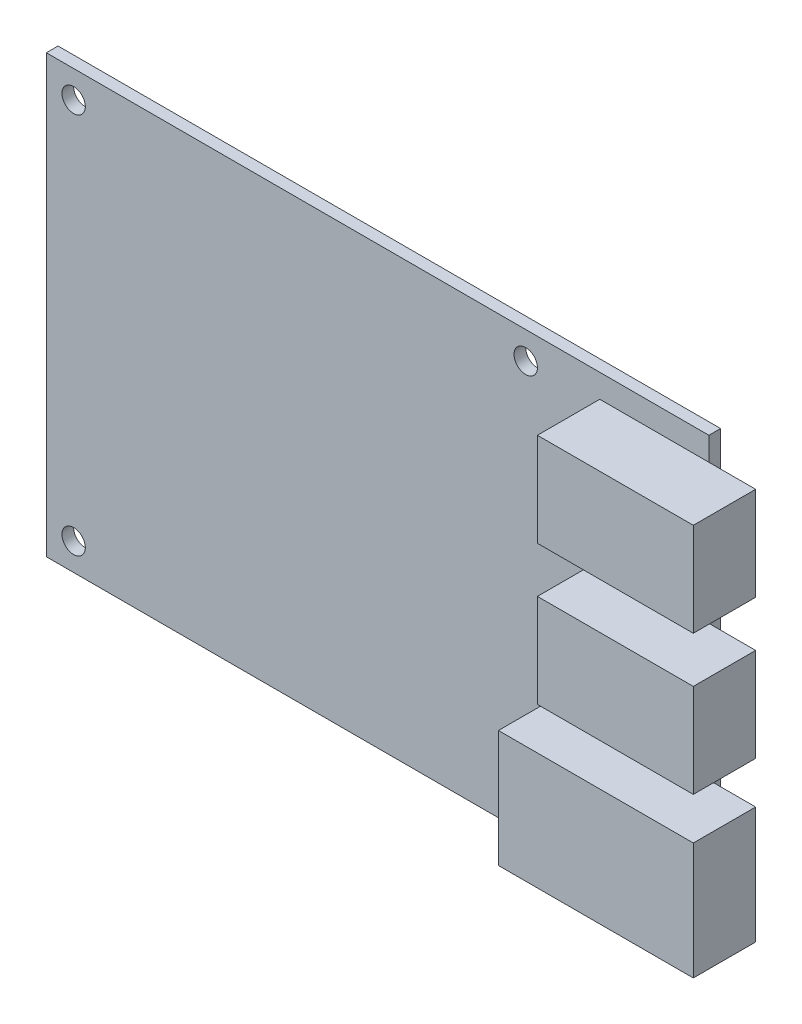
ISO-10303-21;
HEADER;
FILE_DESCRIPTION(('STEP AP214'),'2;1');
FILE_NAME('part.step','',(''),(''),'','','');
FILE_SCHEMA(('AUTOMOTIVE_DESIGN { 1 0 10303 214 1 1 1 1 }'));
ENDSEC;
DATA;
#1=APPLICATION_CONTEXT('core data for automotive mechanical design processes');
#2=APPLICATION_PROTOCOL_DEFINITION('international standard','automotive_design',2000,#1);
#3=PRODUCT_CONTEXT('',#1,'mechanical');
#4=PRODUCT('Part','Part','',(#3));
#5=PRODUCT_RELATED_PRODUCT_CATEGORY('part','',(#4));
#6=PRODUCT_DEFINITION_FORMATION('','',#4);
#7=PRODUCT_DEFINITION_CONTEXT('part definition',#1,'design');
#8=PRODUCT_DEFINITION('design','',#6,#7);
#9=PRODUCT_DEFINITION_SHAPE('','',#8);
#10=(LENGTH_UNIT() NAMED_UNIT(*) SI_UNIT(.MILLI.,.METRE.));
#11=(NAMED_UNIT(*) PLANE_ANGLE_UNIT() SI_UNIT($,.RADIAN.));
#12=(NAMED_UNIT(*) SI_UNIT($,.STERADIAN.) SOLID_ANGLE_UNIT());
#13=UNCERTAINTY_MEASURE_WITH_UNIT(LENGTH_MEASURE(1.E-05),#10,'distance_accuracy_value','');
#14=(GEOMETRIC_REPRESENTATION_CONTEXT(3) GLOBAL_UNCERTAINTY_ASSIGNED_CONTEXT((#13)) GLOBAL_UNIT_ASSIGNED_CONTEXT((#10,
#11,#12)) REPRESENTATION_CONTEXT('',''));
#15=CARTESIAN_POINT('',(0.,0.,0.));
#16=DIRECTION('',(0.,0.,1.));
#17=DIRECTION('',(1.,0.,0.));
#18=AXIS2_PLACEMENT_3D('',#15,#16,#17);
#19=CARTESIAN_POINT('',(0.,0.,1.5));
#20=DIRECTION('',(0.,0.,1.));
#21=DIRECTION('',(1.,0.,0.));
#22=AXIS2_PLACEMENT_3D('',#19,#20,#21);
#23=PLANE('',#22);
#24=CARTESIAN_POINT('',(19.,-24.5,1.5));
#25=DIRECTION('',(0.,0.,1.));
#26=DIRECTION('',(1.,0.,0.));
#27=AXIS2_PLACEMENT_3D('',#24,#25,#26);
#28=CIRCLE('',#27,1.5);
#29=CARTESIAN_POINT('',(20.5,-24.5,1.5));
#30=VERTEX_POINT('',#29);
#31=EDGE_CURVE('E327',#30,#30,#28,.T.);
#32=ORIENTED_EDGE('',*,*,#31,.F.);
#33=EDGE_LOOP('',(#32));
#34=FACE_BOUND('',#33,.T.);
#35=CARTESIAN_POINT('',(-39.,24.5,1.5));
#36=DIRECTION('',(0.,0.,1.));
#37=DIRECTION('',(1.,0.,0.));
#38=AXIS2_PLACEMENT_3D('',#35,#36,#37);
#39=CIRCLE('',#38,1.5);
#40=CARTESIAN_POINT('',(-37.5,24.5,1.5));
#41=VERTEX_POINT('',#40);
#42=EDGE_CURVE('E343',#41,#41,#39,.T.);
#43=ORIENTED_EDGE('',*,*,#42,.F.);
#44=EDGE_LOOP('',(#43));
#45=FACE_BOUND('',#44,.T.);
#46=CARTESIAN_POINT('',(19.,24.5,1.5));
#47=DIRECTION('',(0.,0.,1.));
#48=DIRECTION('',(1.,0.,0.));
#49=AXIS2_PLACEMENT_3D('',#46,#47,#48);
#50=CIRCLE('',#49,1.5);
#51=CARTESIAN_POINT('',(20.5,24.5,1.5));
#52=VERTEX_POINT('',#51);
#53=EDGE_CURVE('E335',#52,#52,#50,.T.);
#54=ORIENTED_EDGE('',*,*,#53,.F.);
#55=EDGE_LOOP('',(#54));
#56=FACE_BOUND('',#55,.T.);
#57=CARTESIAN_POINT('',(-39.,-24.5,1.5));
#58=DIRECTION('',(0.,0.,1.));
#59=DIRECTION('',(1.,0.,0.));
#60=AXIS2_PLACEMENT_3D('',#57,#58,#59);
#61=CIRCLE('',#60,1.5);
#62=CARTESIAN_POINT('',(-37.5,-24.5,1.5));
#63=VERTEX_POINT('',#62);
#64=EDGE_CURVE('E319',#63,#63,#61,.T.);
#65=ORIENTED_EDGE('',*,*,#64,.F.);
#66=EDGE_LOOP('',(#65));
#67=FACE_BOUND('',#66,.T.);
#68=DIRECTION('',(0.,1.,0.));
#69=VECTOR('',#68,1.);
#70=CARTESIAN_POINT('',(42.5,-28.,1.5));
#71=LINE('',#70,#69);
#72=CARTESIAN_POINT('',(42.5,7.09999999999999,1.5));
#73=VERTEX_POINT('',#72);
#74=CARTESIAN_POINT('',(42.5,13.,1.5));
#75=VERTEX_POINT('',#74);
#76=EDGE_CURVE('E412',#73,#75,#71,.T.);
#77=ORIENTED_EDGE('',*,*,#76,.T.);
#78=DIRECTION('',(1.,0.,0.));
#79=VECTOR('',#78,1.);
#80=CARTESIAN_POINT('',(28.5,13.,1.5));
#81=LINE('',#80,#79);
#82=CARTESIAN_POINT('',(28.5,13.,1.5));
#83=VERTEX_POINT('',#82);
#84=EDGE_CURVE('E63',#83,#75,#81,.T.);
#85=ORIENTED_EDGE('',*,*,#84,.F.);
#86=DIRECTION('',(0.,-1.,0.));
#87=VECTOR('',#86,1.);
#88=CARTESIAN_POINT('',(28.5,13.,1.5));
#89=LINE('',#88,#87);
#90=CARTESIAN_POINT('',(28.5,25.,1.5));
#91=VERTEX_POINT('',#90);
#92=EDGE_CURVE('E68',#91,#83,#89,.T.);
#93=ORIENTED_EDGE('',*,*,#92,.F.);
#94=DIRECTION('',(-1.,0.,0.));
#95=VECTOR('',#94,1.);
#96=CARTESIAN_POINT('',(28.5,25.,1.5));
#97=LINE('',#96,#95);
#98=CARTESIAN_POINT('',(42.5,25.,1.5));
#99=VERTEX_POINT('',#98);
#100=EDGE_CURVE('E208',#99,#91,#97,.T.);
#101=ORIENTED_EDGE('',*,*,#100,.F.);
#102=CARTESIAN_POINT('',(42.5,28.,1.5));
#103=VERTEX_POINT('',#102);
#104=EDGE_CURVE('E359',#99,#103,#71,.T.);
#105=ORIENTED_EDGE('',*,*,#104,.T.);
#106=DIRECTION('',(-1.,0.,0.));
#107=VECTOR('',#106,1.);
#108=CARTESIAN_POINT('',(42.5,28.,1.5));
#109=LINE('',#108,#107);
#110=CARTESIAN_POINT('',(-42.5,28.,1.5));
#111=VERTEX_POINT('',#110);
#112=EDGE_CURVE('E363',#103,#111,#109,.T.);
#113=ORIENTED_EDGE('',*,*,#112,.T.);
#114=DIRECTION('',(0.,-1.,0.));
#115=VECTOR('',#114,1.);
#116=CARTESIAN_POINT('',(-42.5,-28.,1.5));
#117=LINE('',#116,#115);
#118=CARTESIAN_POINT('',(-42.5,-28.,1.5));
#119=VERTEX_POINT('',#118);
#120=EDGE_CURVE('E351',#111,#119,#117,.T.);
#121=ORIENTED_EDGE('',*,*,#120,.T.);
#122=DIRECTION('',(1.,0.,0.));
#123=VECTOR('',#122,1.);
#124=CARTESIAN_POINT('',(42.5,-28.,1.5));
#125=LINE('',#124,#123);
#126=CARTESIAN_POINT('',(42.5,-28.,1.5));
#127=VERTEX_POINT('',#126);
#128=EDGE_CURVE('E355',#119,#127,#125,.T.);
#129=ORIENTED_EDGE('',*,*,#128,.T.);
#130=CARTESIAN_POINT('',(42.5,-25.3,1.5));
#131=VERTEX_POINT('',#130);
#132=EDGE_CURVE('E360',#127,#131,#71,.T.);
#133=ORIENTED_EDGE('',*,*,#132,.T.);
#134=DIRECTION('',(1.,0.,0.));
#135=VECTOR('',#134,1.);
#136=CARTESIAN_POINT('',(23.5,-25.3,1.5));
#137=LINE('',#136,#135);
#138=CARTESIAN_POINT('',(23.5,-25.3,1.5));
#139=VERTEX_POINT('',#138);
#140=EDGE_CURVE('E294',#139,#131,#137,.T.);
#141=ORIENTED_EDGE('',*,*,#140,.F.);
#142=DIRECTION('',(0.,-1.,0.));
#143=VECTOR('',#142,1.);
#144=CARTESIAN_POINT('',(23.5,-25.3,1.5));
#145=LINE('',#144,#143);
#146=CARTESIAN_POINT('',(23.5,-10.3,1.5));
#147=VERTEX_POINT('',#146);
#148=EDGE_CURVE('E263',#147,#139,#145,.T.);
#149=ORIENTED_EDGE('',*,*,#148,.F.);
#150=DIRECTION('',(-1.,0.,0.));
#151=VECTOR('',#150,1.);
#152=CARTESIAN_POINT('',(23.5,-10.3,1.5));
#153=LINE('',#152,#151);
#154=CARTESIAN_POINT('',(42.5,-10.3,1.5));
#155=VERTEX_POINT('',#154);
#156=EDGE_CURVE('E11',#155,#147,#153,.T.);
#157=ORIENTED_EDGE('',*,*,#156,.F.);
#158=CARTESIAN_POINT('',(42.5,-4.90000000000001,1.5));
#159=VERTEX_POINT('',#158);
#160=EDGE_CURVE('E418',#155,#159,#71,.T.);
#161=ORIENTED_EDGE('',*,*,#160,.T.);
#162=DIRECTION('',(1.,0.,0.));
#163=VECTOR('',#162,1.);
#164=CARTESIAN_POINT('',(28.5,-4.90000000000001,1.5));
#165=LINE('',#164,#163);
#166=CARTESIAN_POINT('',(28.5,-4.90000000000001,1.5));
#167=VERTEX_POINT('',#166);
#168=EDGE_CURVE('E255',#167,#159,#165,.T.);
#169=ORIENTED_EDGE('',*,*,#168,.F.);
#170=DIRECTION('',(0.,-1.,0.));
#171=VECTOR('',#170,1.);
#172=CARTESIAN_POINT('',(28.5,-4.90000000000001,1.5));
#173=LINE('',#172,#171);
#174=CARTESIAN_POINT('',(28.5,7.09999999999999,1.5));
#175=VERTEX_POINT('',#174);
#176=EDGE_CURVE('E259',#175,#167,#173,.T.);
#177=ORIENTED_EDGE('',*,*,#176,.F.);
#178=DIRECTION('',(-1.,0.,0.));
#179=VECTOR('',#178,1.);
#180=CARTESIAN_POINT('',(28.5,7.09999999999999,1.5));
#181=LINE('',#180,#179);
#182=EDGE_CURVE('E251',#73,#175,#181,.T.);
#183=ORIENTED_EDGE('',*,*,#182,.F.);
#184=EDGE_LOOP('',(#77,#85,#93,#101,#105,#113,#121,#129,#133,#141,#149,#157,#161,#169,#177,#183));
#185=FACE_BOUND('',#184,.T.);
#186=ADVANCED_FACE('F45',(#34,#45,#56,#67,#185),#23,.T.);
#187=CARTESIAN_POINT('',(0.,0.,0.));
#188=DIRECTION('',(0.,0.,1.));
#189=DIRECTION('',(1.,0.,0.));
#190=AXIS2_PLACEMENT_3D('',#187,#188,#189);
#191=PLANE('',#190);
#192=DIRECTION('',(0.,-1.,0.));
#193=VECTOR('',#192,1.);
#194=CARTESIAN_POINT('',(-42.5,-28.,0.));
#195=LINE('',#194,#193);
#196=CARTESIAN_POINT('',(-42.5,28.,0.));
#197=VERTEX_POINT('',#196);
#198=CARTESIAN_POINT('',(-42.5,-28.,0.));
#199=VERTEX_POINT('',#198);
#200=EDGE_CURVE('E347',#197,#199,#195,.T.);
#201=ORIENTED_EDGE('',*,*,#200,.F.);
#202=DIRECTION('',(-1.,0.,0.));
#203=VECTOR('',#202,1.);
#204=CARTESIAN_POINT('',(42.5,28.,0.));
#205=LINE('',#204,#203);
#206=CARTESIAN_POINT('',(42.5,28.,0.));
#207=VERTEX_POINT('',#206);
#208=EDGE_CURVE('E356',#207,#197,#205,.T.);
#209=ORIENTED_EDGE('',*,*,#208,.F.);
#210=DIRECTION('',(0.,1.,0.));
#211=VECTOR('',#210,1.);
#212=CARTESIAN_POINT('',(42.5,-28.,0.));
#213=LINE('',#212,#211);
#214=CARTESIAN_POINT('',(42.5,-28.,0.));
#215=VERTEX_POINT('',#214);
#216=EDGE_CURVE('E374',#215,#207,#213,.T.);
#217=ORIENTED_EDGE('',*,*,#216,.F.);
#218=DIRECTION('',(1.,0.,0.));
#219=VECTOR('',#218,1.);
#220=CARTESIAN_POINT('',(42.5,-28.,0.));
#221=LINE('',#220,#219);
#222=EDGE_CURVE('E371',#199,#215,#221,.T.);
#223=ORIENTED_EDGE('',*,*,#222,.F.);
#224=EDGE_LOOP('',(#201,#209,#217,#223));
#225=FACE_BOUND('',#224,.T.);
#226=CARTESIAN_POINT('',(-39.,24.5,0.));
#227=DIRECTION('',(0.,0.,1.));
#228=DIRECTION('',(1.,0.,0.));
#229=AXIS2_PLACEMENT_3D('',#226,#227,#228);
#230=CIRCLE('',#229,1.5);
#231=CARTESIAN_POINT('',(-37.5,24.5,0.));
#232=VERTEX_POINT('',#231);
#233=EDGE_CURVE('E339',#232,#232,#230,.T.);
#234=ORIENTED_EDGE('',*,*,#233,.T.);
#235=EDGE_LOOP('',(#234));
#236=FACE_BOUND('',#235,.T.);
#237=CARTESIAN_POINT('',(19.,24.5,0.));
#238=DIRECTION('',(0.,0.,1.));
#239=DIRECTION('',(1.,0.,0.));
#240=AXIS2_PLACEMENT_3D('',#237,#238,#239);
#241=CIRCLE('',#240,1.5);
#242=CARTESIAN_POINT('',(20.5,24.5,0.));
#243=VERTEX_POINT('',#242);
#244=EDGE_CURVE('E331',#243,#243,#241,.T.);
#245=ORIENTED_EDGE('',*,*,#244,.T.);
#246=EDGE_LOOP('',(#245));
#247=FACE_BOUND('',#246,.T.);
#248=CARTESIAN_POINT('',(19.,-24.5,0.));
#249=DIRECTION('',(0.,0.,1.));
#250=DIRECTION('',(1.,0.,0.));
#251=AXIS2_PLACEMENT_3D('',#248,#249,#250);
#252=CIRCLE('',#251,1.5);
#253=CARTESIAN_POINT('',(20.5,-24.5,0.));
#254=VERTEX_POINT('',#253);
#255=EDGE_CURVE('E323',#254,#254,#252,.T.);
#256=ORIENTED_EDGE('',*,*,#255,.T.);
#257=EDGE_LOOP('',(#256));
#258=FACE_BOUND('',#257,.T.);
#259=CARTESIAN_POINT('',(-39.,-24.5,0.));
#260=DIRECTION('',(0.,0.,1.));
#261=DIRECTION('',(1.,0.,0.));
#262=AXIS2_PLACEMENT_3D('',#259,#260,#261);
#263=CIRCLE('',#262,1.5);
#264=CARTESIAN_POINT('',(-37.5,-24.5,0.));
#265=VERTEX_POINT('',#264);
#266=EDGE_CURVE('E318',#265,#265,#263,.T.);
#267=ORIENTED_EDGE('',*,*,#266,.T.);
#268=EDGE_LOOP('',(#267));
#269=FACE_BOUND('',#268,.T.);
#270=ADVANCED_FACE('F403',(#225,#236,#247,#258,#269),#191,.F.);
#271=CARTESIAN_POINT('',(-42.5,-28.,1.5));
#272=DIRECTION('',(1.,0.,0.));
#273=DIRECTION('',(0.,0.,-1.));
#274=AXIS2_PLACEMENT_3D('',#271,#272,#273);
#275=PLANE('',#274);
#276=ORIENTED_EDGE('',*,*,#200,.T.);
#277=DIRECTION('',(0.,0.,-1.));
#278=VECTOR('',#277,1.);
#279=CARTESIAN_POINT('',(-42.5,-28.,1.5));
#280=LINE('',#279,#278);
#281=EDGE_CURVE('E49',#119,#199,#280,.T.);
#282=ORIENTED_EDGE('',*,*,#281,.F.);
#283=ORIENTED_EDGE('',*,*,#120,.F.);
#284=DIRECTION('',(0.,0.,-1.));
#285=VECTOR('',#284,1.);
#286=CARTESIAN_POINT('',(-42.5,28.,1.5));
#287=LINE('',#286,#285);
#288=EDGE_CURVE('E367',#111,#197,#287,.T.);
#289=ORIENTED_EDGE('',*,*,#288,.T.);
#290=EDGE_LOOP('',(#276,#282,#283,#289));
#291=FACE_BOUND('',#290,.T.);
#292=ADVANCED_FACE('F47',(#291),#275,.F.);
#293=CARTESIAN_POINT('',(42.5,-28.,1.5));
#294=DIRECTION('',(0.,1.,0.));
#295=DIRECTION('',(-1.,0.,0.));
#296=AXIS2_PLACEMENT_3D('',#293,#294,#295);
#297=PLANE('',#296);
#298=ORIENTED_EDGE('',*,*,#222,.T.);
#299=DIRECTION('',(0.,0.,-1.));
#300=VECTOR('',#299,1.);
#301=CARTESIAN_POINT('',(42.5,-28.,1.5));
#302=LINE('',#301,#300);
#303=EDGE_CURVE('E385',#127,#215,#302,.T.);
#304=ORIENTED_EDGE('',*,*,#303,.F.);
#305=ORIENTED_EDGE('',*,*,#128,.F.);
#306=ORIENTED_EDGE('',*,*,#281,.T.);
#307=EDGE_LOOP('',(#298,#304,#305,#306));
#308=FACE_BOUND('',#307,.T.);
#309=ADVANCED_FACE('F396',(#308),#297,.F.);
#310=CARTESIAN_POINT('',(42.5,-28.,1.5));
#311=DIRECTION('',(-1.,0.,0.));
#312=DIRECTION('',(0.,0.,1.));
#313=AXIS2_PLACEMENT_3D('',#310,#311,#312);
#314=PLANE('',#313);
#315=ORIENTED_EDGE('',*,*,#216,.T.);
#316=DIRECTION('',(0.,0.,-1.));
#317=VECTOR('',#316,1.);
#318=CARTESIAN_POINT('',(42.5,28.,1.5));
#319=LINE('',#318,#317);
#320=EDGE_CURVE('E382',#103,#207,#319,.T.);
#321=ORIENTED_EDGE('',*,*,#320,.F.);
#322=ORIENTED_EDGE('',*,*,#104,.F.);
#323=EDGE_CURVE('E206',#75,#99,#71,.T.);
#324=ORIENTED_EDGE('',*,*,#323,.F.);
#325=ORIENTED_EDGE('',*,*,#76,.F.);
#326=EDGE_CURVE('E414',#159,#73,#71,.T.);
#327=ORIENTED_EDGE('',*,*,#326,.F.);
#328=ORIENTED_EDGE('',*,*,#160,.F.);
#329=EDGE_CURVE('E364',#131,#155,#71,.T.);
#330=ORIENTED_EDGE('',*,*,#329,.F.);
#331=ORIENTED_EDGE('',*,*,#132,.F.);
#332=ORIENTED_EDGE('',*,*,#303,.T.);
#333=EDGE_LOOP('',(#315,#321,#322,#324,#325,#327,#328,#330,#331,#332));
#334=FACE_BOUND('',#333,.T.);
#335=ADVANCED_FACE('F406',(#334),#314,.F.);
#336=CARTESIAN_POINT('',(42.5,28.,1.5));
#337=DIRECTION('',(0.,-1.,0.));
#338=DIRECTION('',(1.,0.,0.));
#339=AXIS2_PLACEMENT_3D('',#336,#337,#338);
#340=PLANE('',#339);
#341=ORIENTED_EDGE('',*,*,#208,.T.);
#342=ORIENTED_EDGE('',*,*,#288,.F.);
#343=ORIENTED_EDGE('',*,*,#112,.F.);
#344=ORIENTED_EDGE('',*,*,#320,.T.);
#345=EDGE_LOOP('',(#341,#342,#343,#344));
#346=FACE_BOUND('',#345,.T.);
#347=ADVANCED_FACE('F409',(#346),#340,.F.);
#348=CARTESIAN_POINT('',(-39.,24.5,1.5));
#349=DIRECTION('',(0.,0.,-1.));
#350=DIRECTION('',(-1.,0.,0.));
#351=AXIS2_PLACEMENT_3D('',#348,#349,#350);
#352=CYLINDRICAL_SURFACE('',#351,1.5);
#353=ORIENTED_EDGE('',*,*,#42,.T.);
#354=EDGE_LOOP('',(#353));
#355=FACE_BOUND('',#354,.T.);
#356=ORIENTED_EDGE('',*,*,#233,.F.);
#357=EDGE_LOOP('',(#356));
#358=FACE_BOUND('',#357,.T.);
#359=ADVANCED_FACE('F484',(#355,#358),#352,.F.);
#360=CARTESIAN_POINT('',(19.,24.5,1.5));
#361=DIRECTION('',(0.,0.,-1.));
#362=DIRECTION('',(-1.,0.,0.));
#363=AXIS2_PLACEMENT_3D('',#360,#361,#362);
#364=CYLINDRICAL_SURFACE('',#363,1.5);
#365=ORIENTED_EDGE('',*,*,#53,.T.);
#366=EDGE_LOOP('',(#365));
#367=FACE_BOUND('',#366,.T.);
#368=ORIENTED_EDGE('',*,*,#244,.F.);
#369=EDGE_LOOP('',(#368));
#370=FACE_BOUND('',#369,.T.);
#371=ADVANCED_FACE('F524',(#367,#370),#364,.F.);
#372=CARTESIAN_POINT('',(19.,-24.5,1.5));
#373=DIRECTION('',(0.,0.,-1.));
#374=DIRECTION('',(-1.,0.,0.));
#375=AXIS2_PLACEMENT_3D('',#372,#373,#374);
#376=CYLINDRICAL_SURFACE('',#375,1.5);
#377=ORIENTED_EDGE('',*,*,#31,.T.);
#378=EDGE_LOOP('',(#377));
#379=FACE_BOUND('',#378,.T.);
#380=ORIENTED_EDGE('',*,*,#255,.F.);
#381=EDGE_LOOP('',(#380));
#382=FACE_BOUND('',#381,.T.);
#383=ADVANCED_FACE('F532',(#379,#382),#376,.F.);
#384=CARTESIAN_POINT('',(-39.,-24.5,1.5));
#385=DIRECTION('',(0.,0.,-1.));
#386=DIRECTION('',(-1.,0.,0.));
#387=AXIS2_PLACEMENT_3D('',#384,#385,#386);
#388=CYLINDRICAL_SURFACE('',#387,1.5);
#389=ORIENTED_EDGE('',*,*,#64,.T.);
#390=EDGE_LOOP('',(#389));
#391=FACE_BOUND('',#390,.T.);
#392=ORIENTED_EDGE('',*,*,#266,.F.);
#393=EDGE_LOOP('',(#392));
#394=FACE_BOUND('',#393,.T.);
#395=ADVANCED_FACE('F540',(#391,#394),#388,.F.);
#396=CARTESIAN_POINT('',(23.5,-25.3,9.5));
#397=DIRECTION('',(1.,0.,0.));
#398=DIRECTION('',(0.,0.,-1.));
#399=AXIS2_PLACEMENT_3D('',#396,#397,#398);
#400=PLANE('',#399);
#401=ORIENTED_EDGE('',*,*,#148,.T.);
#402=DIRECTION('',(0.,0.,-1.));
#403=VECTOR('',#402,1.);
#404=CARTESIAN_POINT('',(23.5,-25.3,9.5));
#405=LINE('',#404,#403);
#406=CARTESIAN_POINT('',(23.5,-25.3,9.5));
#407=VERTEX_POINT('',#406);
#408=EDGE_CURVE('E314',#407,#139,#405,.T.);
#409=ORIENTED_EDGE('',*,*,#408,.F.);
#410=DIRECTION('',(0.,-1.,0.));
#411=VECTOR('',#410,1.);
#412=CARTESIAN_POINT('',(23.5,-25.3,9.5));
#413=LINE('',#412,#411);
#414=CARTESIAN_POINT('',(23.5,-10.3,9.5));
#415=VERTEX_POINT('',#414);
#416=EDGE_CURVE('E276',#415,#407,#413,.T.);
#417=ORIENTED_EDGE('',*,*,#416,.F.);
#418=DIRECTION('',(0.,0.,-1.));
#419=VECTOR('',#418,1.);
#420=CARTESIAN_POINT('',(23.5,-10.3,9.5));
#421=LINE('',#420,#419);
#422=EDGE_CURVE('E289',#415,#147,#421,.T.);
#423=ORIENTED_EDGE('',*,*,#422,.T.);
#424=EDGE_LOOP('',(#401,#409,#417,#423));
#425=FACE_BOUND('',#424,.T.);
#426=ADVANCED_FACE('F548',(#425),#400,.F.);
#427=CARTESIAN_POINT('',(23.5,-25.3,9.5));
#428=DIRECTION('',(0.,1.,0.));
#429=DIRECTION('',(0.,0.,1.));
#430=AXIS2_PLACEMENT_3D('',#427,#428,#429);
#431=PLANE('',#430);
#432=ORIENTED_EDGE('',*,*,#140,.T.);
#433=CARTESIAN_POINT('',(48.5,-25.3,1.5));
#434=VERTEX_POINT('',#433);
#435=EDGE_CURVE('E293',#131,#434,#137,.T.);
#436=ORIENTED_EDGE('',*,*,#435,.T.);
#437=DIRECTION('',(0.,0.,-1.));
#438=VECTOR('',#437,1.);
#439=CARTESIAN_POINT('',(48.5,-25.3,9.5));
#440=LINE('',#439,#438);
#441=CARTESIAN_POINT('',(48.5,-25.3,9.5));
#442=VERTEX_POINT('',#441);
#443=EDGE_CURVE('E310',#442,#434,#440,.T.);
#444=ORIENTED_EDGE('',*,*,#443,.F.);
#445=DIRECTION('',(1.,0.,0.));
#446=VECTOR('',#445,1.);
#447=CARTESIAN_POINT('',(23.5,-25.3,9.5));
#448=LINE('',#447,#446);
#449=EDGE_CURVE('E280',#407,#442,#448,.T.);
#450=ORIENTED_EDGE('',*,*,#449,.F.);
#451=ORIENTED_EDGE('',*,*,#408,.T.);
#452=EDGE_LOOP('',(#432,#436,#444,#450,#451));
#453=FACE_BOUND('',#452,.T.);
#454=ADVANCED_FACE('F443',(#453),#431,.F.);
#455=CARTESIAN_POINT('',(48.5,-25.3,9.5));
#456=DIRECTION('',(-1.,0.,0.));
#457=DIRECTION('',(0.,0.,1.));
#458=AXIS2_PLACEMENT_3D('',#455,#456,#457);
#459=PLANE('',#458);
#460=DIRECTION('',(0.,1.,0.));
#461=VECTOR('',#460,1.);
#462=CARTESIAN_POINT('',(48.5,-25.3,1.5));
#463=LINE('',#462,#461);
#464=CARTESIAN_POINT('',(48.5,-10.3,1.5));
#465=VERTEX_POINT('',#464);
#466=EDGE_CURVE('E298',#434,#465,#463,.T.);
#467=ORIENTED_EDGE('',*,*,#466,.T.);
#468=DIRECTION('',(0.,0.,-1.));
#469=VECTOR('',#468,1.);
#470=CARTESIAN_POINT('',(48.5,-10.3,9.5));
#471=LINE('',#470,#469);
#472=CARTESIAN_POINT('',(48.5,-10.3,9.5));
#473=VERTEX_POINT('',#472);
#474=EDGE_CURVE('E306',#473,#465,#471,.T.);
#475=ORIENTED_EDGE('',*,*,#474,.F.);
#476=DIRECTION('',(0.,1.,0.));
#477=VECTOR('',#476,1.);
#478=CARTESIAN_POINT('',(48.5,-25.3,9.5));
#479=LINE('',#478,#477);
#480=EDGE_CURVE('E283',#442,#473,#479,.T.);
#481=ORIENTED_EDGE('',*,*,#480,.F.);
#482=ORIENTED_EDGE('',*,*,#443,.T.);
#483=EDGE_LOOP('',(#467,#475,#481,#482));
#484=FACE_BOUND('',#483,.T.);
#485=ADVANCED_FACE('F440',(#484),#459,.F.);
#486=CARTESIAN_POINT('',(23.5,-10.3,9.5));
#487=DIRECTION('',(0.,-1.,0.));
#488=DIRECTION('',(0.,0.,-1.));
#489=AXIS2_PLACEMENT_3D('',#486,#487,#488);
#490=PLANE('',#489);
#491=EDGE_CURVE('E56',#465,#155,#153,.T.);
#492=ORIENTED_EDGE('',*,*,#491,.T.);
#493=ORIENTED_EDGE('',*,*,#156,.T.);
#494=ORIENTED_EDGE('',*,*,#422,.F.);
#495=DIRECTION('',(-1.,0.,0.));
#496=VECTOR('',#495,1.);
#497=CARTESIAN_POINT('',(23.5,-10.3,9.5));
#498=LINE('',#497,#496);
#499=EDGE_CURVE('E286',#473,#415,#498,.T.);
#500=ORIENTED_EDGE('',*,*,#499,.F.);
#501=ORIENTED_EDGE('',*,*,#474,.T.);
#502=EDGE_LOOP('',(#492,#493,#494,#500,#501));
#503=FACE_BOUND('',#502,.T.);
#504=ADVANCED_FACE('F434',(#503),#490,.F.);
#505=CARTESIAN_POINT('',(0.,0.,9.5));
#506=DIRECTION('',(0.,0.,-1.));
#507=DIRECTION('',(-1.,0.,0.));
#508=AXIS2_PLACEMENT_3D('',#505,#506,#507);
#509=PLANE('',#508);
#510=ORIENTED_EDGE('',*,*,#416,.T.);
#511=ORIENTED_EDGE('',*,*,#449,.T.);
#512=ORIENTED_EDGE('',*,*,#480,.T.);
#513=ORIENTED_EDGE('',*,*,#499,.T.);
#514=EDGE_LOOP('',(#510,#511,#512,#513));
#515=FACE_BOUND('',#514,.T.);
#516=ADVANCED_FACE('F583',(#515),#509,.F.);
#517=CARTESIAN_POINT('',(0.,0.,1.5));
#518=DIRECTION('',(0.,0.,-1.));
#519=DIRECTION('',(-1.,0.,0.));
#520=AXIS2_PLACEMENT_3D('',#517,#518,#519);
#521=PLANE('',#520);
#522=ORIENTED_EDGE('',*,*,#435,.F.);
#523=ORIENTED_EDGE('',*,*,#329,.T.);
#524=ORIENTED_EDGE('',*,*,#491,.F.);
#525=ORIENTED_EDGE('',*,*,#466,.F.);
#526=EDGE_LOOP('',(#522,#523,#524,#525));
#527=FACE_BOUND('',#526,.T.);
#528=ADVANCED_FACE('F431',(#527),#521,.T.);
#529=CARTESIAN_POINT('',(0.,0.,1.5));
#530=DIRECTION('',(0.,0.,-1.));
#531=DIRECTION('',(-1.,0.,0.));
#532=AXIS2_PLACEMENT_3D('',#529,#530,#531);
#533=PLANE('',#532);
#534=ORIENTED_EDGE('',*,*,#326,.T.);
#535=CARTESIAN_POINT('',(48.5,7.09999999999999,1.5));
#536=VERTEX_POINT('',#535);
#537=EDGE_CURVE('E246',#536,#73,#181,.T.);
#538=ORIENTED_EDGE('',*,*,#537,.F.);
#539=DIRECTION('',(0.,1.,0.));
#540=VECTOR('',#539,1.);
#541=CARTESIAN_POINT('',(48.5,-4.90000000000001,1.5));
#542=LINE('',#541,#540);
#543=CARTESIAN_POINT('',(48.5,-4.90000000000001,1.5));
#544=VERTEX_POINT('',#543);
#545=EDGE_CURVE('E250',#544,#536,#542,.T.);
#546=ORIENTED_EDGE('',*,*,#545,.F.);
#547=EDGE_CURVE('E254',#159,#544,#165,.T.);
#548=ORIENTED_EDGE('',*,*,#547,.F.);
#549=EDGE_LOOP('',(#534,#538,#546,#548));
#550=FACE_BOUND('',#549,.T.);
#551=ADVANCED_FACE('F599',(#550),#533,.T.);
#552=CARTESIAN_POINT('',(28.5,-4.90000000000001,9.5));
#553=DIRECTION('',(1.,0.,0.));
#554=DIRECTION('',(0.,1.,0.));
#555=AXIS2_PLACEMENT_3D('',#552,#553,#554);
#556=PLANE('',#555);
#557=ORIENTED_EDGE('',*,*,#176,.T.);
#558=DIRECTION('',(0.,0.,-1.));
#559=VECTOR('',#558,1.);
#560=CARTESIAN_POINT('',(28.5,-4.90000000000001,9.5));
#561=LINE('',#560,#559);
#562=CARTESIAN_POINT('',(28.5,-4.90000000000001,9.5));
#563=VERTEX_POINT('',#562);
#564=EDGE_CURVE('E218',#563,#167,#561,.T.);
#565=ORIENTED_EDGE('',*,*,#564,.F.);
#566=DIRECTION('',(0.,-1.,0.));
#567=VECTOR('',#566,1.);
#568=CARTESIAN_POINT('',(28.5,-4.90000000000001,9.5));
#569=LINE('',#568,#567);
#570=CARTESIAN_POINT('',(28.5,7.09999999999999,9.5));
#571=VERTEX_POINT('',#570);
#572=EDGE_CURVE('E272',#571,#563,#569,.T.);
#573=ORIENTED_EDGE('',*,*,#572,.F.);
#574=DIRECTION('',(0.,0.,-1.));
#575=VECTOR('',#574,1.);
#576=CARTESIAN_POINT('',(28.5,7.09999999999999,9.5));
#577=LINE('',#576,#575);
#578=EDGE_CURVE('E241',#571,#175,#577,.T.);
#579=ORIENTED_EDGE('',*,*,#578,.T.);
#580=EDGE_LOOP('',(#557,#565,#573,#579));
#581=FACE_BOUND('',#580,.T.);
#582=ADVANCED_FACE('F607',(#581),#556,.F.);
#583=CARTESIAN_POINT('',(28.5,-4.90000000000001,9.5));
#584=DIRECTION('',(0.,1.,0.));
#585=DIRECTION('',(0.,0.,1.));
#586=AXIS2_PLACEMENT_3D('',#583,#584,#585);
#587=PLANE('',#586);
#588=ORIENTED_EDGE('',*,*,#168,.T.);
#589=ORIENTED_EDGE('',*,*,#547,.T.);
#590=DIRECTION('',(0.,0.,-1.));
#591=VECTOR('',#590,1.);
#592=CARTESIAN_POINT('',(48.5,-4.90000000000001,9.5));
#593=LINE('',#592,#591);
#594=CARTESIAN_POINT('',(48.5,-4.90000000000001,9.5));
#595=VERTEX_POINT('',#594);
#596=EDGE_CURVE('E233',#595,#544,#593,.T.);
#597=ORIENTED_EDGE('',*,*,#596,.F.);
#598=DIRECTION('',(1.,0.,0.));
#599=VECTOR('',#598,1.);
#600=CARTESIAN_POINT('',(28.5,-4.90000000000001,9.5));
#601=LINE('',#600,#599);
#602=EDGE_CURVE('E269',#563,#595,#601,.T.);
#603=ORIENTED_EDGE('',*,*,#602,.F.);
#604=ORIENTED_EDGE('',*,*,#564,.T.);
#605=EDGE_LOOP('',(#588,#589,#597,#603,#604));
#606=FACE_BOUND('',#605,.T.);
#607=ADVANCED_FACE('F615',(#606),#587,.F.);
#608=CARTESIAN_POINT('',(48.5,-4.90000000000001,9.5));
#609=DIRECTION('',(-1.,0.,0.));
#610=DIRECTION('',(0.,0.,1.));
#611=AXIS2_PLACEMENT_3D('',#608,#609,#610);
#612=PLANE('',#611);
#613=ORIENTED_EDGE('',*,*,#545,.T.);
#614=DIRECTION('',(0.,0.,-1.));
#615=VECTOR('',#614,1.);
#616=CARTESIAN_POINT('',(48.5,7.09999999999999,9.5));
#617=LINE('',#616,#615);
#618=CARTESIAN_POINT('',(48.5,7.09999999999999,9.5));
#619=VERTEX_POINT('',#618);
#620=EDGE_CURVE('E237',#619,#536,#617,.T.);
#621=ORIENTED_EDGE('',*,*,#620,.F.);
#622=DIRECTION('',(0.,1.,0.));
#623=VECTOR('',#622,1.);
#624=CARTESIAN_POINT('',(48.5,-4.90000000000001,9.5));
#625=LINE('',#624,#623);
#626=EDGE_CURVE('E266',#595,#619,#625,.T.);
#627=ORIENTED_EDGE('',*,*,#626,.F.);
#628=ORIENTED_EDGE('',*,*,#596,.T.);
#629=EDGE_LOOP('',(#613,#621,#627,#628));
#630=FACE_BOUND('',#629,.T.);
#631=ADVANCED_FACE('F623',(#630),#612,.F.);
#632=CARTESIAN_POINT('',(28.5,7.09999999999999,9.5));
#633=DIRECTION('',(0.,-1.,0.));
#634=DIRECTION('',(1.,0.,0.));
#635=AXIS2_PLACEMENT_3D('',#632,#633,#634);
#636=PLANE('',#635);
#637=ORIENTED_EDGE('',*,*,#537,.T.);
#638=ORIENTED_EDGE('',*,*,#182,.T.);
#639=ORIENTED_EDGE('',*,*,#578,.F.);
#640=DIRECTION('',(-1.,0.,0.));
#641=VECTOR('',#640,1.);
#642=CARTESIAN_POINT('',(28.5,7.09999999999999,9.5));
#643=LINE('',#642,#641);
#644=EDGE_CURVE('E245',#619,#571,#643,.T.);
#645=ORIENTED_EDGE('',*,*,#644,.F.);
#646=ORIENTED_EDGE('',*,*,#620,.T.);
#647=EDGE_LOOP('',(#637,#638,#639,#645,#646));
#648=FACE_BOUND('',#647,.T.);
#649=ADVANCED_FACE('F632',(#648),#636,.F.);
#650=CARTESIAN_POINT('',(0.,0.,9.5));
#651=DIRECTION('',(0.,0.,-1.));
#652=DIRECTION('',(-1.,0.,0.));
#653=AXIS2_PLACEMENT_3D('',#650,#651,#652);
#654=PLANE('',#653);
#655=ORIENTED_EDGE('',*,*,#572,.T.);
#656=ORIENTED_EDGE('',*,*,#602,.T.);
#657=ORIENTED_EDGE('',*,*,#626,.T.);
#658=ORIENTED_EDGE('',*,*,#644,.T.);
#659=EDGE_LOOP('',(#655,#656,#657,#658));
#660=FACE_BOUND('',#659,.T.);
#661=ADVANCED_FACE('F641',(#660),#654,.F.);
#662=CARTESIAN_POINT('',(0.,0.,1.5));
#663=DIRECTION('',(0.,0.,-1.));
#664=DIRECTION('',(-1.,0.,0.));
#665=AXIS2_PLACEMENT_3D('',#662,#663,#664);
#666=PLANE('',#665);
#667=ORIENTED_EDGE('',*,*,#323,.T.);
#668=CARTESIAN_POINT('',(48.5,25.,1.5));
#669=VERTEX_POINT('',#668);
#670=EDGE_CURVE('E194',#669,#99,#97,.T.);
#671=ORIENTED_EDGE('',*,*,#670,.F.);
#672=DIRECTION('',(0.,1.,0.));
#673=VECTOR('',#672,1.);
#674=CARTESIAN_POINT('',(48.5,13.,1.5));
#675=LINE('',#674,#673);
#676=CARTESIAN_POINT('',(48.5,13.,1.5));
#677=VERTEX_POINT('',#676);
#678=EDGE_CURVE('E181',#677,#669,#675,.T.);
#679=ORIENTED_EDGE('',*,*,#678,.F.);
#680=EDGE_CURVE('E193',#75,#677,#81,.T.);
#681=ORIENTED_EDGE('',*,*,#680,.F.);
#682=EDGE_LOOP('',(#667,#671,#679,#681));
#683=FACE_BOUND('',#682,.T.);
#684=ADVANCED_FACE('F205',(#683),#666,.T.);
#685=CARTESIAN_POINT('',(28.5,13.,9.5));
#686=DIRECTION('',(1.,0.,0.));
#687=DIRECTION('',(0.,1.,0.));
#688=AXIS2_PLACEMENT_3D('',#685,#686,#687);
#689=PLANE('',#688);
#690=ORIENTED_EDGE('',*,*,#92,.T.);
#691=DIRECTION('',(0.,0.,-1.));
#692=VECTOR('',#691,1.);
#693=CARTESIAN_POINT('',(28.5,13.,9.5));
#694=LINE('',#693,#692);
#695=CARTESIAN_POINT('',(28.5,13.,9.5));
#696=VERTEX_POINT('',#695);
#697=EDGE_CURVE('E452',#696,#83,#694,.T.);
#698=ORIENTED_EDGE('',*,*,#697,.F.);
#699=DIRECTION('',(0.,-1.,0.));
#700=VECTOR('',#699,1.);
#701=CARTESIAN_POINT('',(28.5,13.,9.5));
#702=LINE('',#701,#700);
#703=CARTESIAN_POINT('',(28.5,25.,9.5));
#704=VERTEX_POINT('',#703);
#705=EDGE_CURVE('E211',#704,#696,#702,.T.);
#706=ORIENTED_EDGE('',*,*,#705,.F.);
#707=DIRECTION('',(0.,0.,-1.));
#708=VECTOR('',#707,1.);
#709=CARTESIAN_POINT('',(28.5,25.,9.5));
#710=LINE('',#709,#708);
#711=EDGE_CURVE('E202',#704,#91,#710,.T.);
#712=ORIENTED_EDGE('',*,*,#711,.T.);
#713=EDGE_LOOP('',(#690,#698,#706,#712));
#714=FACE_BOUND('',#713,.T.);
#715=ADVANCED_FACE('F458',(#714),#689,.F.);
#716=CARTESIAN_POINT('',(28.5,13.,9.5));
#717=DIRECTION('',(0.,1.,0.));
#718=DIRECTION('',(0.,0.,1.));
#719=AXIS2_PLACEMENT_3D('',#716,#717,#718);
#720=PLANE('',#719);
#721=ORIENTED_EDGE('',*,*,#84,.T.);
#722=ORIENTED_EDGE('',*,*,#680,.T.);
#723=DIRECTION('',(0.,0.,-1.));
#724=VECTOR('',#723,1.);
#725=CARTESIAN_POINT('',(48.5,13.,9.5));
#726=LINE('',#725,#724);
#727=CARTESIAN_POINT('',(48.5,13.,9.5));
#728=VERTEX_POINT('',#727);
#729=EDGE_CURVE('E188',#728,#677,#726,.T.);
#730=ORIENTED_EDGE('',*,*,#729,.F.);
#731=DIRECTION('',(1.,0.,0.));
#732=VECTOR('',#731,1.);
#733=CARTESIAN_POINT('',(28.5,13.,9.5));
#734=LINE('',#733,#732);
#735=EDGE_CURVE('E224',#696,#728,#734,.T.);
#736=ORIENTED_EDGE('',*,*,#735,.F.);
#737=ORIENTED_EDGE('',*,*,#697,.T.);
#738=EDGE_LOOP('',(#721,#722,#730,#736,#737));
#739=FACE_BOUND('',#738,.T.);
#740=ADVANCED_FACE('F450',(#739),#720,.F.);
#741=CARTESIAN_POINT('',(48.5,13.,9.5));
#742=DIRECTION('',(-1.,0.,0.));
#743=DIRECTION('',(0.,0.,1.));
#744=AXIS2_PLACEMENT_3D('',#741,#742,#743);
#745=PLANE('',#744);
#746=ORIENTED_EDGE('',*,*,#678,.T.);
#747=DIRECTION('',(0.,0.,-1.));
#748=VECTOR('',#747,1.);
#749=CARTESIAN_POINT('',(48.5,25.,9.5));
#750=LINE('',#749,#748);
#751=CARTESIAN_POINT('',(48.5,25.,9.5));
#752=VERTEX_POINT('',#751);
#753=EDGE_CURVE('E185',#752,#669,#750,.T.);
#754=ORIENTED_EDGE('',*,*,#753,.F.);
#755=DIRECTION('',(0.,1.,0.));
#756=VECTOR('',#755,1.);
#757=CARTESIAN_POINT('',(48.5,13.,9.5));
#758=LINE('',#757,#756);
#759=EDGE_CURVE('E221',#728,#752,#758,.T.);
#760=ORIENTED_EDGE('',*,*,#759,.F.);
#761=ORIENTED_EDGE('',*,*,#729,.T.);
#762=EDGE_LOOP('',(#746,#754,#760,#761));
#763=FACE_BOUND('',#762,.T.);
#764=ADVANCED_FACE('F183',(#763),#745,.F.);
#765=CARTESIAN_POINT('',(28.5,25.,9.5));
#766=DIRECTION('',(0.,-1.,0.));
#767=DIRECTION('',(1.,0.,0.));
#768=AXIS2_PLACEMENT_3D('',#765,#766,#767);
#769=PLANE('',#768);
#770=ORIENTED_EDGE('',*,*,#670,.T.);
#771=ORIENTED_EDGE('',*,*,#100,.T.);
#772=ORIENTED_EDGE('',*,*,#711,.F.);
#773=DIRECTION('',(-1.,0.,0.));
#774=VECTOR('',#773,1.);
#775=CARTESIAN_POINT('',(28.5,25.,9.5));
#776=LINE('',#775,#774);
#777=EDGE_CURVE('E200',#752,#704,#776,.T.);
#778=ORIENTED_EDGE('',*,*,#777,.F.);
#779=ORIENTED_EDGE('',*,*,#753,.T.);
#780=EDGE_LOOP('',(#770,#771,#772,#778,#779));
#781=FACE_BOUND('',#780,.T.);
#782=ADVANCED_FACE('F198',(#781),#769,.F.);
#783=CARTESIAN_POINT('',(0.,0.,9.5));
#784=DIRECTION('',(0.,0.,-1.));
#785=DIRECTION('',(-1.,0.,0.));
#786=AXIS2_PLACEMENT_3D('',#783,#784,#785);
#787=PLANE('',#786);
#788=ORIENTED_EDGE('',*,*,#705,.T.);
#789=ORIENTED_EDGE('',*,*,#735,.T.);
#790=ORIENTED_EDGE('',*,*,#759,.T.);
#791=ORIENTED_EDGE('',*,*,#777,.T.);
#792=EDGE_LOOP('',(#788,#789,#790,#791));
#793=FACE_BOUND('',#792,.T.);
#794=ADVANCED_FACE('F463',(#793),#787,.F.);
#795=CLOSED_SHELL('',(#186,#270,#292,#309,#335,#347,#359,#371,#383,#395,#426,#454,#485,#504,
#516,#528,#551,#582,#607,#631,#649,#661,#684,#715,#740,#764,#782,#794));
#796=MANIFOLD_SOLID_BREP('B2',#795);
#797=ADVANCED_BREP_SHAPE_REPRESENTATION('',(#18,#796),#14);
#798=SHAPE_DEFINITION_REPRESENTATION(#9,#797);
ENDSEC;
END-ISO-10303-21;
